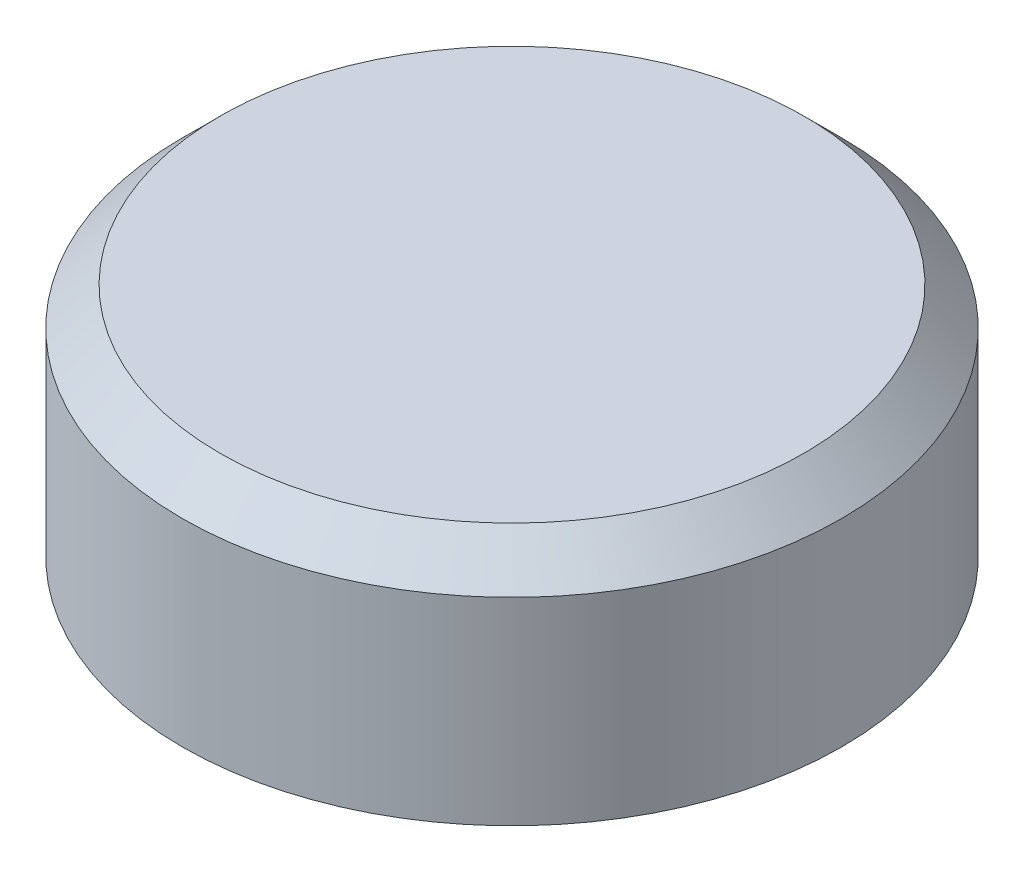
ISO-10303-21;
HEADER;
FILE_DESCRIPTION(('STEP AP214'),'2;1');
FILE_NAME('part.step','',(''),(''),'','','');
FILE_SCHEMA(('AUTOMOTIVE_DESIGN { 1 0 10303 214 1 1 1 1 }'));
ENDSEC;
DATA;
#1=APPLICATION_CONTEXT('core data for automotive mechanical design processes');
#2=APPLICATION_PROTOCOL_DEFINITION('international standard','automotive_design',2000,#1);
#3=PRODUCT_CONTEXT('',#1,'mechanical');
#4=PRODUCT('Part','Part','',(#3));
#5=PRODUCT_RELATED_PRODUCT_CATEGORY('part','',(#4));
#6=PRODUCT_DEFINITION_FORMATION('','',#4);
#7=PRODUCT_DEFINITION_CONTEXT('part definition',#1,'design');
#8=PRODUCT_DEFINITION('design','',#6,#7);
#9=PRODUCT_DEFINITION_SHAPE('','',#8);
#10=(LENGTH_UNIT() NAMED_UNIT(*) SI_UNIT(.MILLI.,.METRE.));
#11=(NAMED_UNIT(*) PLANE_ANGLE_UNIT() SI_UNIT($,.RADIAN.));
#12=(NAMED_UNIT(*) SI_UNIT($,.STERADIAN.) SOLID_ANGLE_UNIT());
#13=UNCERTAINTY_MEASURE_WITH_UNIT(LENGTH_MEASURE(1.E-05),#10,'distance_accuracy_value','');
#14=(GEOMETRIC_REPRESENTATION_CONTEXT(3) GLOBAL_UNCERTAINTY_ASSIGNED_CONTEXT((#13)) GLOBAL_UNIT_ASSIGNED_CONTEXT((#10,
#11,#12)) REPRESENTATION_CONTEXT('',''));
#15=CARTESIAN_POINT('',(0.,0.,0.));
#16=DIRECTION('',(0.,0.,1.));
#17=DIRECTION('',(1.,0.,0.));
#18=AXIS2_PLACEMENT_3D('',#15,#16,#17);
#19=CARTESIAN_POINT('',(0.,-12.5,0.));
#20=DIRECTION('',(0.,1.,0.));
#21=DIRECTION('',(0.,0.,1.));
#22=AXIS2_PLACEMENT_3D('',#19,#20,#21);
#23=CYLINDRICAL_SURFACE('',#22,17.5);
#24=CARTESIAN_POINT('',(0.,-2.00000000000002,0.));
#25=DIRECTION('',(0.,1.,0.));
#26=DIRECTION('',(0.,0.,1.));
#27=AXIS2_PLACEMENT_3D('',#24,#25,#26);
#28=CIRCLE('',#27,17.5);
#29=CARTESIAN_POINT('',(0.,-2.00000000000002,17.5));
#30=VERTEX_POINT('',#29);
#31=EDGE_CURVE('E43',#30,#30,#28,.F.);
#32=ORIENTED_EDGE('',*,*,#31,.T.);
#33=EDGE_LOOP('',(#32));
#34=FACE_BOUND('',#33,.T.);
#35=CARTESIAN_POINT('',(0.,-12.5,0.));
#36=DIRECTION('',(0.,1.,0.));
#37=DIRECTION('',(0.,0.,1.));
#38=AXIS2_PLACEMENT_3D('',#35,#36,#37);
#39=CIRCLE('',#38,17.5);
#40=CARTESIAN_POINT('',(0.,-12.5,17.5));
#41=VERTEX_POINT('',#40);
#42=EDGE_CURVE('E52',#41,#41,#39,.T.);
#43=ORIENTED_EDGE('',*,*,#42,.T.);
#44=EDGE_LOOP('',(#43));
#45=FACE_BOUND('',#44,.T.);
#46=ADVANCED_FACE('F32',(#34,#45),#23,.T.);
#47=CARTESIAN_POINT('',(0.,-12.5,0.));
#48=DIRECTION('',(0.,1.,0.));
#49=DIRECTION('',(0.,0.,1.));
#50=AXIS2_PLACEMENT_3D('',#47,#48,#49);
#51=PLANE('',#50);
#52=CARTESIAN_POINT('',(0.,-12.5,0.));
#53=DIRECTION('',(0.,-1.,0.));
#54=DIRECTION('',(0.,0.,-1.));
#55=AXIS2_PLACEMENT_3D('',#52,#53,#54);
#56=CIRCLE('',#55,15.9);
#57=CARTESIAN_POINT('',(0.,-12.5,-15.9));
#58=VERTEX_POINT('',#57);
#59=EDGE_CURVE('E55',#58,#58,#56,.T.);
#60=ORIENTED_EDGE('',*,*,#59,.F.);
#61=EDGE_LOOP('',(#60));
#62=FACE_BOUND('',#61,.T.);
#63=ORIENTED_EDGE('',*,*,#42,.F.);
#64=EDGE_LOOP('',(#63));
#65=FACE_BOUND('',#64,.T.);
#66=ADVANCED_FACE('F61',(#62,#65),#51,.F.);
#67=CARTESIAN_POINT('',(0.,0.,0.));
#68=DIRECTION('',(0.,1.,0.));
#69=DIRECTION('',(0.,0.,1.));
#70=AXIS2_PLACEMENT_3D('',#67,#68,#69);
#71=PLANE('',#70);
#72=CARTESIAN_POINT('',(0.,0.,0.));
#73=DIRECTION('',(0.,1.,0.));
#74=DIRECTION('',(0.,0.,1.));
#75=AXIS2_PLACEMENT_3D('',#72,#73,#74);
#76=CIRCLE('',#75,15.5);
#77=CARTESIAN_POINT('',(0.,0.,15.5));
#78=VERTEX_POINT('',#77);
#79=EDGE_CURVE('E47',#78,#78,#76,.T.);
#80=ORIENTED_EDGE('',*,*,#79,.T.);
#81=EDGE_LOOP('',(#80));
#82=FACE_BOUND('',#81,.T.);
#83=ADVANCED_FACE('F64',(#82),#71,.T.);
#84=CARTESIAN_POINT('',(0.,-1.5,0.));
#85=DIRECTION('',(0.,-1.,0.));
#86=DIRECTION('',(0.,0.,-1.));
#87=AXIS2_PLACEMENT_3D('',#84,#85,#86);
#88=CYLINDRICAL_SURFACE('',#87,15.9);
#89=CARTESIAN_POINT('',(0.,-3.49999999999999,0.));
#90=DIRECTION('',(0.,-1.,0.));
#91=DIRECTION('',(0.,0.,-1.));
#92=AXIS2_PLACEMENT_3D('',#89,#90,#91);
#93=CIRCLE('',#92,15.9);
#94=CARTESIAN_POINT('',(0.,-3.49999999999999,-15.9));
#95=VERTEX_POINT('',#94);
#96=EDGE_CURVE('E10',#95,#95,#93,.F.);
#97=ORIENTED_EDGE('',*,*,#96,.T.);
#98=EDGE_LOOP('',(#97));
#99=FACE_BOUND('',#98,.T.);
#100=ORIENTED_EDGE('',*,*,#59,.T.);
#101=EDGE_LOOP('',(#100));
#102=FACE_BOUND('',#101,.T.);
#103=ADVANCED_FACE('F59',(#99,#102),#88,.F.);
#104=CARTESIAN_POINT('',(0.,-1.5,0.));
#105=DIRECTION('',(0.,-1.,0.));
#106=DIRECTION('',(0.,0.,-1.));
#107=AXIS2_PLACEMENT_3D('',#104,#105,#106);
#108=PLANE('',#107);
#109=CARTESIAN_POINT('',(0.,-1.5,0.));
#110=DIRECTION('',(0.,-1.,0.));
#111=DIRECTION('',(0.,0.,-1.));
#112=AXIS2_PLACEMENT_3D('',#109,#110,#111);
#113=CIRCLE('',#112,13.9);
#114=CARTESIAN_POINT('',(0.,-1.5,-13.9));
#115=VERTEX_POINT('',#114);
#116=EDGE_CURVE('E39',#115,#115,#113,.T.);
#117=ORIENTED_EDGE('',*,*,#116,.T.);
#118=EDGE_LOOP('',(#117));
#119=FACE_BOUND('',#118,.T.);
#120=ADVANCED_FACE('F76',(#119),#108,.T.);
#121=CARTESIAN_POINT('',(0.,0.,0.));
#122=DIRECTION('',(0.,-1.,0.));
#123=DIRECTION('',(0.,0.,-1.));
#124=AXIS2_PLACEMENT_3D('',#121,#122,#123);
#125=CONICAL_SURFACE('',#124,15.5,0.785398163397445);
#126=ORIENTED_EDGE('',*,*,#31,.F.);
#127=EDGE_LOOP('',(#126));
#128=FACE_BOUND('',#127,.T.);
#129=ORIENTED_EDGE('',*,*,#79,.F.);
#130=EDGE_LOOP('',(#129));
#131=FACE_BOUND('',#130,.T.);
#132=ADVANCED_FACE('F74',(#128,#131),#125,.T.);
#133=CARTESIAN_POINT('',(0.,-1.5,0.));
#134=DIRECTION('',(0.,-1.,0.));
#135=DIRECTION('',(0.,0.,-1.));
#136=AXIS2_PLACEMENT_3D('',#133,#134,#135);
#137=CONICAL_SURFACE('',#136,13.9,0.785398163397453);
#138=ORIENTED_EDGE('',*,*,#96,.F.);
#139=EDGE_LOOP('',(#138));
#140=FACE_BOUND('',#139,.T.);
#141=ORIENTED_EDGE('',*,*,#116,.F.);
#142=EDGE_LOOP('',(#141));
#143=FACE_BOUND('',#142,.T.);
#144=ADVANCED_FACE('F34',(#140,#143),#137,.F.);
#145=CLOSED_SHELL('',(#46,#66,#83,#103,#120,#132,#144));
#146=MANIFOLD_SOLID_BREP('B2',#145);
#147=ADVANCED_BREP_SHAPE_REPRESENTATION('',(#18,#146),#14);
#148=SHAPE_DEFINITION_REPRESENTATION(#9,#147);
ENDSEC;
END-ISO-10303-21;
